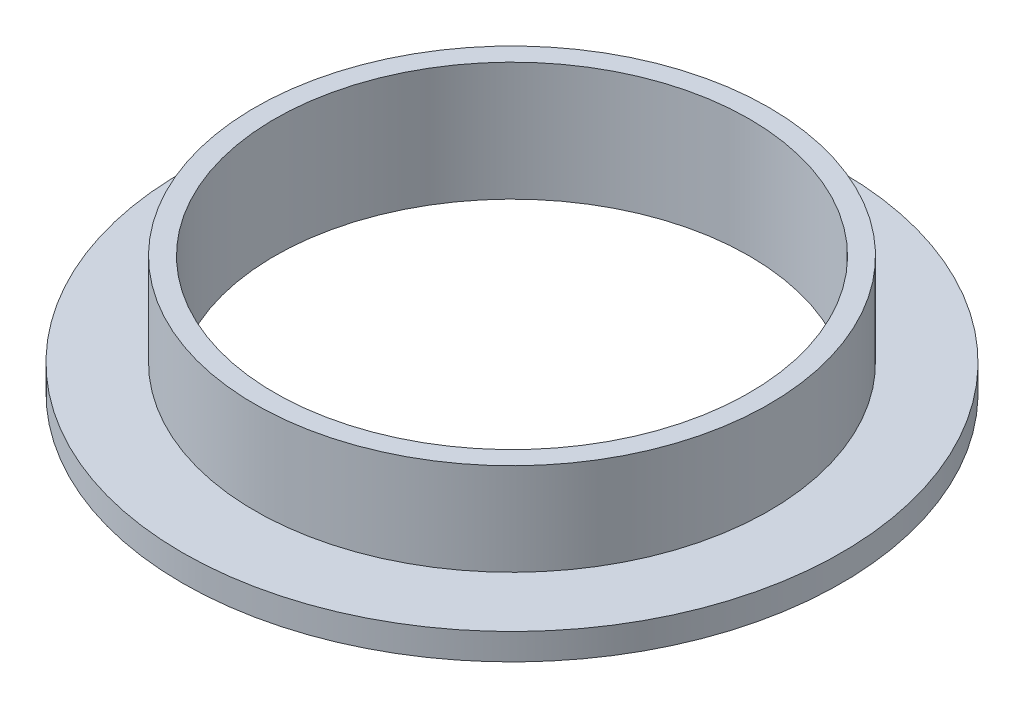
ISO-10303-21;
HEADER;
FILE_DESCRIPTION(('STEP AP214'),'2;1');
FILE_NAME('part.step','',(''),(''),'','','');
FILE_SCHEMA(('AUTOMOTIVE_DESIGN { 1 0 10303 214 1 1 1 1 }'));
ENDSEC;
DATA;
#1=APPLICATION_CONTEXT('core data for automotive mechanical design processes');
#2=APPLICATION_PROTOCOL_DEFINITION('international standard','automotive_design',2000,#1);
#3=PRODUCT_CONTEXT('',#1,'mechanical');
#4=PRODUCT('Part','Part','',(#3));
#5=PRODUCT_RELATED_PRODUCT_CATEGORY('part','',(#4));
#6=PRODUCT_DEFINITION_FORMATION('','',#4);
#7=PRODUCT_DEFINITION_CONTEXT('part definition',#1,'design');
#8=PRODUCT_DEFINITION('design','',#6,#7);
#9=PRODUCT_DEFINITION_SHAPE('','',#8);
#10=(LENGTH_UNIT() NAMED_UNIT(*) SI_UNIT(.MILLI.,.METRE.));
#11=(NAMED_UNIT(*) PLANE_ANGLE_UNIT() SI_UNIT($,.RADIAN.));
#12=(NAMED_UNIT(*) SI_UNIT($,.STERADIAN.) SOLID_ANGLE_UNIT());
#13=UNCERTAINTY_MEASURE_WITH_UNIT(LENGTH_MEASURE(1.E-05),#10,'distance_accuracy_value','');
#14=(GEOMETRIC_REPRESENTATION_CONTEXT(3) GLOBAL_UNCERTAINTY_ASSIGNED_CONTEXT((#13)) GLOBAL_UNIT_ASSIGNED_CONTEXT((#10,
#11,#12)) REPRESENTATION_CONTEXT('',''));
#15=CARTESIAN_POINT('',(0.,0.,0.));
#16=DIRECTION('',(0.,0.,1.));
#17=DIRECTION('',(1.,0.,0.));
#18=AXIS2_PLACEMENT_3D('',#15,#16,#17);
#19=CARTESIAN_POINT('',(0.,0.,0.));
#20=DIRECTION('',(0.,-1.,0.));
#21=DIRECTION('',(0.,0.,-1.));
#22=AXIS2_PLACEMENT_3D('',#19,#20,#21);
#23=CYLINDRICAL_SURFACE('',#22,18.);
#24=CARTESIAN_POINT('',(0.,0.,0.));
#25=DIRECTION('',(0.,-1.,0.));
#26=DIRECTION('',(0.,0.,-1.));
#27=AXIS2_PLACEMENT_3D('',#24,#25,#26);
#28=CIRCLE('',#27,18.);
#29=CARTESIAN_POINT('',(0.,0.,-18.));
#30=VERTEX_POINT('',#29);
#31=EDGE_CURVE('E10',#30,#30,#28,.T.);
#32=ORIENTED_EDGE('',*,*,#31,.T.);
#33=EDGE_LOOP('',(#32));
#34=FACE_BOUND('',#33,.T.);
#35=CARTESIAN_POINT('',(0.,9.,0.));
#36=DIRECTION('',(0.,-1.,0.));
#37=DIRECTION('',(0.,0.,-1.));
#38=AXIS2_PLACEMENT_3D('',#35,#36,#37);
#39=CIRCLE('',#38,18.);
#40=CARTESIAN_POINT('',(0.,9.,-18.));
#41=VERTEX_POINT('',#40);
#42=EDGE_CURVE('E62',#41,#41,#39,.T.);
#43=ORIENTED_EDGE('',*,*,#42,.F.);
#44=EDGE_LOOP('',(#43));
#45=FACE_BOUND('',#44,.T.);
#46=ADVANCED_FACE('F35',(#34,#45),#23,.F.);
#47=CARTESIAN_POINT('',(18.,0.,0.));
#48=DIRECTION('',(0.,-1.,0.));
#49=DIRECTION('',(0.,0.,-1.));
#50=AXIS2_PLACEMENT_3D('',#47,#48,#49);
#51=PLANE('',#50);
#52=CARTESIAN_POINT('',(0.,0.,0.));
#53=DIRECTION('',(0.,-1.,0.));
#54=DIRECTION('',(0.,0.,-1.));
#55=AXIS2_PLACEMENT_3D('',#52,#53,#54);
#56=CIRCLE('',#55,25.);
#57=CARTESIAN_POINT('',(0.,0.,-25.));
#58=VERTEX_POINT('',#57);
#59=EDGE_CURVE('E42',#58,#58,#56,.T.);
#60=ORIENTED_EDGE('',*,*,#59,.T.);
#61=EDGE_LOOP('',(#60));
#62=FACE_BOUND('',#61,.T.);
#63=ORIENTED_EDGE('',*,*,#31,.F.);
#64=EDGE_LOOP('',(#63));
#65=FACE_BOUND('',#64,.T.);
#66=ADVANCED_FACE('F71',(#62,#65),#51,.T.);
#67=CARTESIAN_POINT('',(0.,0.,0.));
#68=DIRECTION('',(0.,-1.,0.));
#69=DIRECTION('',(0.,0.,-1.));
#70=AXIS2_PLACEMENT_3D('',#67,#68,#69);
#71=CYLINDRICAL_SURFACE('',#70,25.);
#72=CARTESIAN_POINT('',(0.,2.,0.));
#73=DIRECTION('',(0.,-1.,0.));
#74=DIRECTION('',(0.,0.,-1.));
#75=AXIS2_PLACEMENT_3D('',#72,#73,#74);
#76=CIRCLE('',#75,25.);
#77=CARTESIAN_POINT('',(0.,2.,-25.));
#78=VERTEX_POINT('',#77);
#79=EDGE_CURVE('E49',#78,#78,#76,.T.);
#80=ORIENTED_EDGE('',*,*,#79,.T.);
#81=EDGE_LOOP('',(#80));
#82=FACE_BOUND('',#81,.T.);
#83=ORIENTED_EDGE('',*,*,#59,.F.);
#84=EDGE_LOOP('',(#83));
#85=FACE_BOUND('',#84,.T.);
#86=ADVANCED_FACE('F75',(#82,#85),#71,.T.);
#87=CARTESIAN_POINT('',(25.,2.,0.));
#88=DIRECTION('',(0.,1.,0.));
#89=DIRECTION('',(0.,0.,1.));
#90=AXIS2_PLACEMENT_3D('',#87,#88,#89);
#91=PLANE('',#90);
#92=CARTESIAN_POINT('',(0.,2.,0.));
#93=DIRECTION('',(0.,-1.,0.));
#94=DIRECTION('',(0.,0.,-1.));
#95=AXIS2_PLACEMENT_3D('',#92,#93,#94);
#96=CIRCLE('',#95,19.5);
#97=CARTESIAN_POINT('',(0.,2.,-19.5));
#98=VERTEX_POINT('',#97);
#99=EDGE_CURVE('E54',#98,#98,#96,.T.);
#100=ORIENTED_EDGE('',*,*,#99,.T.);
#101=EDGE_LOOP('',(#100));
#102=FACE_BOUND('',#101,.T.);
#103=ORIENTED_EDGE('',*,*,#79,.F.);
#104=EDGE_LOOP('',(#103));
#105=FACE_BOUND('',#104,.T.);
#106=ADVANCED_FACE('F79',(#102,#105),#91,.T.);
#107=CARTESIAN_POINT('',(0.,0.,0.));
#108=DIRECTION('',(0.,-1.,0.));
#109=DIRECTION('',(0.,0.,-1.));
#110=AXIS2_PLACEMENT_3D('',#107,#108,#109);
#111=CYLINDRICAL_SURFACE('',#110,19.5);
#112=CARTESIAN_POINT('',(0.,9.,0.));
#113=DIRECTION('',(0.,-1.,0.));
#114=DIRECTION('',(0.,0.,-1.));
#115=AXIS2_PLACEMENT_3D('',#112,#113,#114);
#116=CIRCLE('',#115,19.5);
#117=CARTESIAN_POINT('',(0.,9.,-19.5));
#118=VERTEX_POINT('',#117);
#119=EDGE_CURVE('E59',#118,#118,#116,.T.);
#120=ORIENTED_EDGE('',*,*,#119,.T.);
#121=EDGE_LOOP('',(#120));
#122=FACE_BOUND('',#121,.T.);
#123=ORIENTED_EDGE('',*,*,#99,.F.);
#124=EDGE_LOOP('',(#123));
#125=FACE_BOUND('',#124,.T.);
#126=ADVANCED_FACE('F86',(#122,#125),#111,.T.);
#127=CARTESIAN_POINT('',(19.5,9.,0.));
#128=DIRECTION('',(0.,1.,0.));
#129=DIRECTION('',(0.,0.,1.));
#130=AXIS2_PLACEMENT_3D('',#127,#128,#129);
#131=PLANE('',#130);
#132=ORIENTED_EDGE('',*,*,#42,.T.);
#133=EDGE_LOOP('',(#132));
#134=FACE_BOUND('',#133,.T.);
#135=ORIENTED_EDGE('',*,*,#119,.F.);
#136=EDGE_LOOP('',(#135));
#137=FACE_BOUND('',#136,.T.);
#138=ADVANCED_FACE('F67',(#134,#137),#131,.T.);
#139=CLOSED_SHELL('',(#46,#66,#86,#106,#126,#138));
#140=MANIFOLD_SOLID_BREP('B2',#139);
#141=ADVANCED_BREP_SHAPE_REPRESENTATION('',(#18,#140),#14);
#142=SHAPE_DEFINITION_REPRESENTATION(#9,#141);
ENDSEC;
END-ISO-10303-21;
